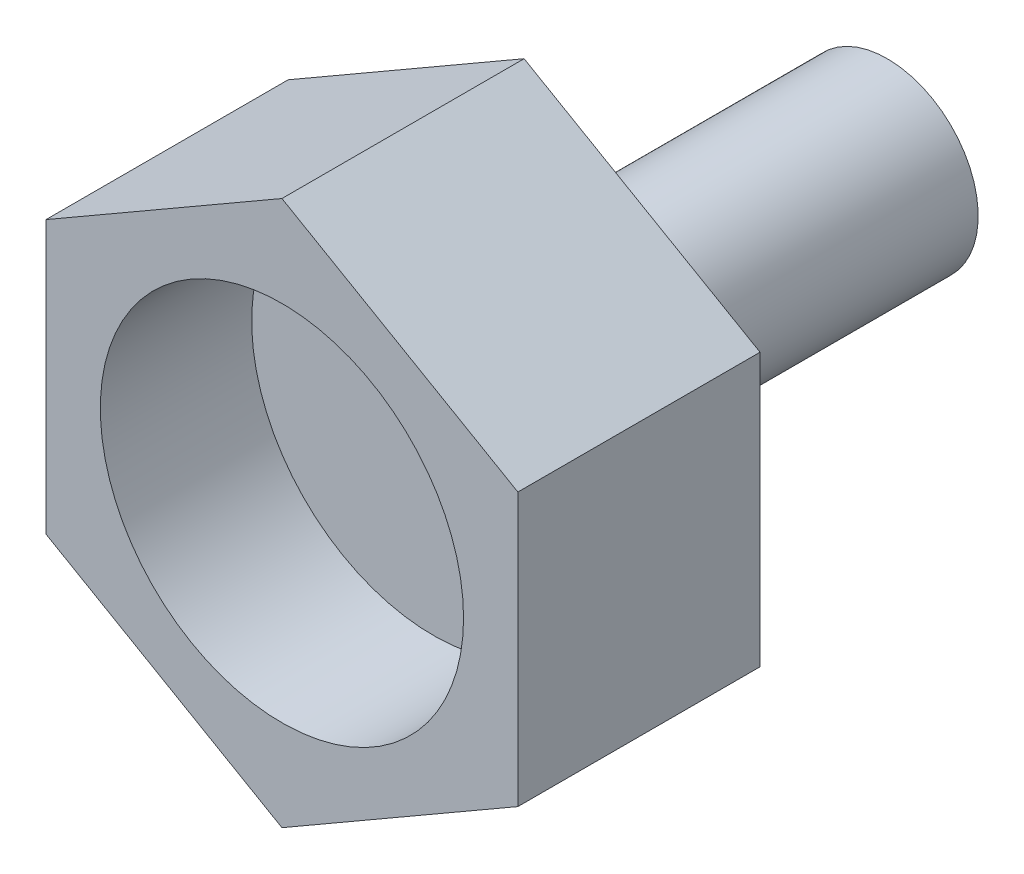
ISO-10303-21;
HEADER;
FILE_DESCRIPTION(('STEP AP214'),'2;1');
FILE_NAME('part.step','',(''),(''),'','','');
FILE_SCHEMA(('AUTOMOTIVE_DESIGN { 1 0 10303 214 1 1 1 1 }'));
ENDSEC;
DATA;
#1=APPLICATION_CONTEXT('core data for automotive mechanical design processes');
#2=APPLICATION_PROTOCOL_DEFINITION('international standard','automotive_design',2000,#1);
#3=PRODUCT_CONTEXT('',#1,'mechanical');
#4=PRODUCT('Part','Part','',(#3));
#5=PRODUCT_RELATED_PRODUCT_CATEGORY('part','',(#4));
#6=PRODUCT_DEFINITION_FORMATION('','',#4);
#7=PRODUCT_DEFINITION_CONTEXT('part definition',#1,'design');
#8=PRODUCT_DEFINITION('design','',#6,#7);
#9=PRODUCT_DEFINITION_SHAPE('','',#8);
#10=(LENGTH_UNIT() NAMED_UNIT(*) SI_UNIT(.MILLI.,.METRE.));
#11=(NAMED_UNIT(*) PLANE_ANGLE_UNIT() SI_UNIT($,.RADIAN.));
#12=(NAMED_UNIT(*) SI_UNIT($,.STERADIAN.) SOLID_ANGLE_UNIT());
#13=UNCERTAINTY_MEASURE_WITH_UNIT(LENGTH_MEASURE(1.E-05),#10,'distance_accuracy_value','');
#14=(GEOMETRIC_REPRESENTATION_CONTEXT(3) GLOBAL_UNCERTAINTY_ASSIGNED_CONTEXT((#13)) GLOBAL_UNIT_ASSIGNED_CONTEXT((#10,
#11,#12)) REPRESENTATION_CONTEXT('',''));
#15=CARTESIAN_POINT('',(0.,0.,0.));
#16=DIRECTION('',(0.,0.,1.));
#17=DIRECTION('',(1.,0.,0.));
#18=AXIS2_PLACEMENT_3D('',#15,#16,#17);
#19=CARTESIAN_POINT('',(0.,-4.5,4.));
#20=DIRECTION('',(-0.5,0.866025403784439,0.));
#21=DIRECTION('',(-0.866025403784439,-0.5,0.));
#22=AXIS2_PLACEMENT_3D('',#19,#20,#21);
#23=PLANE('',#22);
#24=DIRECTION('',(0.866025403784439,0.5,0.));
#25=VECTOR('',#24,1.);
#26=CARTESIAN_POINT('',(0.,-4.5,0.));
#27=LINE('',#26,#25);
#28=CARTESIAN_POINT('',(0.,-4.5,0.));
#29=VERTEX_POINT('',#28);
#30=CARTESIAN_POINT('',(3.89711431702997,-2.25,0.));
#31=VERTEX_POINT('',#30);
#32=EDGE_CURVE('E123',#29,#31,#27,.T.);
#33=ORIENTED_EDGE('',*,*,#32,.T.);
#34=DIRECTION('',(0.,0.,-1.));
#35=VECTOR('',#34,1.);
#36=CARTESIAN_POINT('',(3.89711431702997,-2.25,4.));
#37=LINE('',#36,#35);
#38=CARTESIAN_POINT('',(3.89711431702997,-2.25,4.));
#39=VERTEX_POINT('',#38);
#40=EDGE_CURVE('E40',#39,#31,#37,.T.);
#41=ORIENTED_EDGE('',*,*,#40,.F.);
#42=DIRECTION('',(0.866025403784439,0.5,0.));
#43=VECTOR('',#42,1.);
#44=CARTESIAN_POINT('',(0.,-4.5,4.));
#45=LINE('',#44,#43);
#46=CARTESIAN_POINT('',(0.,-4.5,4.));
#47=VERTEX_POINT('',#46);
#48=EDGE_CURVE('E134',#47,#39,#45,.T.);
#49=ORIENTED_EDGE('',*,*,#48,.F.);
#50=DIRECTION('',(0.,0.,-1.));
#51=VECTOR('',#50,1.);
#52=CARTESIAN_POINT('',(0.,-4.5,4.));
#53=LINE('',#52,#51);
#54=EDGE_CURVE('E119',#47,#29,#53,.T.);
#55=ORIENTED_EDGE('',*,*,#54,.T.);
#56=EDGE_LOOP('',(#33,#41,#49,#55));
#57=FACE_BOUND('',#56,.T.);
#58=ADVANCED_FACE('F37',(#57),#23,.F.);
#59=CARTESIAN_POINT('',(3.89711431702997,-2.25,4.));
#60=DIRECTION('',(-1.,0.,0.));
#61=DIRECTION('',(0.,-1.,0.));
#62=AXIS2_PLACEMENT_3D('',#59,#60,#61);
#63=PLANE('',#62);
#64=DIRECTION('',(0.,1.,0.));
#65=VECTOR('',#64,1.);
#66=CARTESIAN_POINT('',(3.89711431702997,-2.25,0.));
#67=LINE('',#66,#65);
#68=CARTESIAN_POINT('',(3.89711431702997,2.25,0.));
#69=VERTEX_POINT('',#68);
#70=EDGE_CURVE('E126',#31,#69,#67,.T.);
#71=ORIENTED_EDGE('',*,*,#70,.T.);
#72=DIRECTION('',(0.,0.,-1.));
#73=VECTOR('',#72,1.);
#74=CARTESIAN_POINT('',(3.89711431702997,2.25,4.));
#75=LINE('',#74,#73);
#76=CARTESIAN_POINT('',(3.89711431702997,2.25,4.));
#77=VERTEX_POINT('',#76);
#78=EDGE_CURVE('E137',#77,#69,#75,.T.);
#79=ORIENTED_EDGE('',*,*,#78,.F.);
#80=DIRECTION('',(0.,1.,0.));
#81=VECTOR('',#80,1.);
#82=CARTESIAN_POINT('',(3.89711431702997,-2.25,4.));
#83=LINE('',#82,#81);
#84=EDGE_CURVE('E92',#39,#77,#83,.T.);
#85=ORIENTED_EDGE('',*,*,#84,.F.);
#86=ORIENTED_EDGE('',*,*,#40,.T.);
#87=EDGE_LOOP('',(#71,#79,#85,#86));
#88=FACE_BOUND('',#87,.T.);
#89=ADVANCED_FACE('F142',(#88),#63,.F.);
#90=CARTESIAN_POINT('',(3.89711431702997,2.25,4.));
#91=DIRECTION('',(-0.5,-0.866025403784439,0.));
#92=DIRECTION('',(0.866025403784439,-0.5,0.));
#93=AXIS2_PLACEMENT_3D('',#90,#91,#92);
#94=PLANE('',#93);
#95=DIRECTION('',(-0.866025403784439,0.5,0.));
#96=VECTOR('',#95,1.);
#97=CARTESIAN_POINT('',(3.89711431702997,2.25,0.));
#98=LINE('',#97,#96);
#99=CARTESIAN_POINT('',(0.,4.5,0.));
#100=VERTEX_POINT('',#99);
#101=EDGE_CURVE('E129',#69,#100,#98,.T.);
#102=ORIENTED_EDGE('',*,*,#101,.T.);
#103=DIRECTION('',(0.,0.,-1.));
#104=VECTOR('',#103,1.);
#105=CARTESIAN_POINT('',(0.,4.5,4.));
#106=LINE('',#105,#104);
#107=CARTESIAN_POINT('',(0.,4.5,4.));
#108=VERTEX_POINT('',#107);
#109=EDGE_CURVE('E114',#108,#100,#106,.T.);
#110=ORIENTED_EDGE('',*,*,#109,.F.);
#111=DIRECTION('',(-0.866025403784439,0.5,0.));
#112=VECTOR('',#111,1.);
#113=CARTESIAN_POINT('',(3.89711431702997,2.25,4.));
#114=LINE('',#113,#112);
#115=EDGE_CURVE('E105',#77,#108,#114,.T.);
#116=ORIENTED_EDGE('',*,*,#115,.F.);
#117=ORIENTED_EDGE('',*,*,#78,.T.);
#118=EDGE_LOOP('',(#102,#110,#116,#117));
#119=FACE_BOUND('',#118,.T.);
#120=ADVANCED_FACE('F148',(#119),#94,.F.);
#121=CARTESIAN_POINT('',(0.,4.5,4.));
#122=DIRECTION('',(0.5,-0.866025403784439,0.));
#123=DIRECTION('',(0.866025403784439,0.5,0.));
#124=AXIS2_PLACEMENT_3D('',#121,#122,#123);
#125=PLANE('',#124);
#126=DIRECTION('',(-0.866025403784439,-0.5,0.));
#127=VECTOR('',#126,1.);
#128=CARTESIAN_POINT('',(0.,4.5,0.));
#129=LINE('',#128,#127);
#130=CARTESIAN_POINT('',(-3.89711431702997,2.25,0.));
#131=VERTEX_POINT('',#130);
#132=EDGE_CURVE('E113',#100,#131,#129,.T.);
#133=ORIENTED_EDGE('',*,*,#132,.T.);
#134=DIRECTION('',(0.,0.,-1.));
#135=VECTOR('',#134,1.);
#136=CARTESIAN_POINT('',(-3.89711431702997,2.25,4.));
#137=LINE('',#136,#135);
#138=CARTESIAN_POINT('',(-3.89711431702997,2.25,4.));
#139=VERTEX_POINT('',#138);
#140=EDGE_CURVE('E110',#139,#131,#137,.T.);
#141=ORIENTED_EDGE('',*,*,#140,.F.);
#142=DIRECTION('',(-0.866025403784439,-0.5,0.));
#143=VECTOR('',#142,1.);
#144=CARTESIAN_POINT('',(0.,4.5,4.));
#145=LINE('',#144,#143);
#146=EDGE_CURVE('E99',#108,#139,#145,.T.);
#147=ORIENTED_EDGE('',*,*,#146,.F.);
#148=ORIENTED_EDGE('',*,*,#109,.T.);
#149=EDGE_LOOP('',(#133,#141,#147,#148));
#150=FACE_BOUND('',#149,.T.);
#151=ADVANCED_FACE('F111',(#150),#125,.F.);
#152=CARTESIAN_POINT('',(-3.89711431702997,2.25,4.));
#153=DIRECTION('',(1.,0.,0.));
#154=DIRECTION('',(0.,1.,0.));
#155=AXIS2_PLACEMENT_3D('',#152,#153,#154);
#156=PLANE('',#155);
#157=DIRECTION('',(0.,-1.,0.));
#158=VECTOR('',#157,1.);
#159=CARTESIAN_POINT('',(-3.89711431702997,2.25,0.));
#160=LINE('',#159,#158);
#161=CARTESIAN_POINT('',(-3.89711431702997,-2.25,0.));
#162=VERTEX_POINT('',#161);
#163=EDGE_CURVE('E77',#131,#162,#160,.T.);
#164=ORIENTED_EDGE('',*,*,#163,.T.);
#165=DIRECTION('',(0.,0.,-1.));
#166=VECTOR('',#165,1.);
#167=CARTESIAN_POINT('',(-3.89711431702997,-2.25,4.));
#168=LINE('',#167,#166);
#169=CARTESIAN_POINT('',(-3.89711431702997,-2.25,4.));
#170=VERTEX_POINT('',#169);
#171=EDGE_CURVE('E115',#170,#162,#168,.T.);
#172=ORIENTED_EDGE('',*,*,#171,.F.);
#173=DIRECTION('',(0.,-1.,0.));
#174=VECTOR('',#173,1.);
#175=CARTESIAN_POINT('',(-3.89711431702997,2.25,4.));
#176=LINE('',#175,#174);
#177=EDGE_CURVE('E103',#139,#170,#176,.T.);
#178=ORIENTED_EDGE('',*,*,#177,.F.);
#179=ORIENTED_EDGE('',*,*,#140,.T.);
#180=EDGE_LOOP('',(#164,#172,#178,#179));
#181=FACE_BOUND('',#180,.T.);
#182=ADVANCED_FACE('F117',(#181),#156,.F.);
#183=CARTESIAN_POINT('',(-3.89711431702997,-2.25,4.));
#184=DIRECTION('',(0.5,0.866025403784439,0.));
#185=DIRECTION('',(-0.866025403784439,0.5,0.));
#186=AXIS2_PLACEMENT_3D('',#183,#184,#185);
#187=PLANE('',#186);
#188=DIRECTION('',(0.866025403784439,-0.5,0.));
#189=VECTOR('',#188,1.);
#190=CARTESIAN_POINT('',(-3.89711431702997,-2.25,0.));
#191=LINE('',#190,#189);
#192=EDGE_CURVE('E83',#162,#29,#191,.T.);
#193=ORIENTED_EDGE('',*,*,#192,.T.);
#194=ORIENTED_EDGE('',*,*,#54,.F.);
#195=DIRECTION('',(0.866025403784439,-0.5,0.));
#196=VECTOR('',#195,1.);
#197=CARTESIAN_POINT('',(-3.89711431702997,-2.25,4.));
#198=LINE('',#197,#196);
#199=EDGE_CURVE('E54',#170,#47,#198,.T.);
#200=ORIENTED_EDGE('',*,*,#199,.F.);
#201=ORIENTED_EDGE('',*,*,#171,.T.);
#202=EDGE_LOOP('',(#193,#194,#200,#201));
#203=FACE_BOUND('',#202,.T.);
#204=ADVANCED_FACE('F171',(#203),#187,.F.);
#205=CARTESIAN_POINT('',(0.,0.,4.));
#206=DIRECTION('',(0.,0.,1.));
#207=DIRECTION('',(1.,0.,0.));
#208=AXIS2_PLACEMENT_3D('',#205,#206,#207);
#209=PLANE('',#208);
#210=CARTESIAN_POINT('',(0.,0.,4.));
#211=DIRECTION('',(0.,0.,1.));
#212=DIRECTION('',(1.,0.,0.));
#213=AXIS2_PLACEMENT_3D('',#210,#211,#212);
#214=CIRCLE('',#213,3.);
#215=CARTESIAN_POINT('',(3.,0.,4.));
#216=VERTEX_POINT('',#215);
#217=EDGE_CURVE('E155',#216,#216,#214,.T.);
#218=ORIENTED_EDGE('',*,*,#217,.F.);
#219=EDGE_LOOP('',(#218));
#220=FACE_BOUND('',#219,.T.);
#221=ORIENTED_EDGE('',*,*,#48,.T.);
#222=ORIENTED_EDGE('',*,*,#84,.T.);
#223=ORIENTED_EDGE('',*,*,#115,.T.);
#224=ORIENTED_EDGE('',*,*,#146,.T.);
#225=ORIENTED_EDGE('',*,*,#177,.T.);
#226=ORIENTED_EDGE('',*,*,#199,.T.);
#227=EDGE_LOOP('',(#221,#222,#223,#224,#225,#226));
#228=FACE_BOUND('',#227,.T.);
#229=ADVANCED_FACE('F101',(#220,#228),#209,.T.);
#230=CARTESIAN_POINT('',(0.,0.,0.));
#231=DIRECTION('',(0.,0.,1.));
#232=DIRECTION('',(1.,0.,0.));
#233=AXIS2_PLACEMENT_3D('',#230,#231,#232);
#234=PLANE('',#233);
#235=CARTESIAN_POINT('',(0.,0.,0.));
#236=DIRECTION('',(0.,0.,-1.));
#237=DIRECTION('',(-1.,0.,0.));
#238=AXIS2_PLACEMENT_3D('',#235,#236,#237);
#239=CIRCLE('',#238,1.5);
#240=CARTESIAN_POINT('',(-1.5,0.,0.));
#241=VERTEX_POINT('',#240);
#242=EDGE_CURVE('E11',#241,#241,#239,.T.);
#243=ORIENTED_EDGE('',*,*,#242,.F.);
#244=EDGE_LOOP('',(#243));
#245=FACE_BOUND('',#244,.T.);
#246=ORIENTED_EDGE('',*,*,#32,.F.);
#247=ORIENTED_EDGE('',*,*,#192,.F.);
#248=ORIENTED_EDGE('',*,*,#163,.F.);
#249=ORIENTED_EDGE('',*,*,#132,.F.);
#250=ORIENTED_EDGE('',*,*,#101,.F.);
#251=ORIENTED_EDGE('',*,*,#70,.F.);
#252=EDGE_LOOP('',(#246,#247,#248,#249,#250,#251));
#253=FACE_BOUND('',#252,.T.);
#254=ADVANCED_FACE('F147',(#245,#253),#234,.F.);
#255=CARTESIAN_POINT('',(0.,0.,-6.));
#256=DIRECTION('',(0.,0.,1.));
#257=DIRECTION('',(1.,0.,0.));
#258=AXIS2_PLACEMENT_3D('',#255,#256,#257);
#259=CYLINDRICAL_SURFACE('',#258,1.5);
#260=CARTESIAN_POINT('',(0.,0.,-6.));
#261=DIRECTION('',(0.,0.,-1.));
#262=DIRECTION('',(-1.,0.,0.));
#263=AXIS2_PLACEMENT_3D('',#260,#261,#262);
#264=CIRCLE('',#263,1.5);
#265=CARTESIAN_POINT('',(-1.5,0.,-6.));
#266=VERTEX_POINT('',#265);
#267=EDGE_CURVE('E127',#266,#266,#264,.T.);
#268=ORIENTED_EDGE('',*,*,#267,.F.);
#269=EDGE_LOOP('',(#268));
#270=FACE_BOUND('',#269,.T.);
#271=ORIENTED_EDGE('',*,*,#242,.T.);
#272=EDGE_LOOP('',(#271));
#273=FACE_BOUND('',#272,.T.);
#274=ADVANCED_FACE('F177',(#270,#273),#259,.T.);
#275=CARTESIAN_POINT('',(0.,0.,-6.));
#276=DIRECTION('',(0.,0.,-1.));
#277=DIRECTION('',(-1.,0.,0.));
#278=AXIS2_PLACEMENT_3D('',#275,#276,#277);
#279=PLANE('',#278);
#280=ORIENTED_EDGE('',*,*,#267,.T.);
#281=EDGE_LOOP('',(#280));
#282=FACE_BOUND('',#281,.T.);
#283=ADVANCED_FACE('F166',(#282),#279,.T.);
#284=CARTESIAN_POINT('',(0.,0.,1.5));
#285=DIRECTION('',(0.,0.,1.));
#286=DIRECTION('',(1.,0.,0.));
#287=AXIS2_PLACEMENT_3D('',#284,#285,#286);
#288=CYLINDRICAL_SURFACE('',#287,3.);
#289=CARTESIAN_POINT('',(0.,0.,1.5));
#290=DIRECTION('',(0.,0.,1.));
#291=DIRECTION('',(1.,0.,0.));
#292=AXIS2_PLACEMENT_3D('',#289,#290,#291);
#293=CIRCLE('',#292,3.);
#294=CARTESIAN_POINT('',(3.,0.,1.5));
#295=VERTEX_POINT('',#294);
#296=EDGE_CURVE('E154',#295,#295,#293,.T.);
#297=ORIENTED_EDGE('',*,*,#296,.F.);
#298=EDGE_LOOP('',(#297));
#299=FACE_BOUND('',#298,.T.);
#300=ORIENTED_EDGE('',*,*,#217,.T.);
#301=EDGE_LOOP('',(#300));
#302=FACE_BOUND('',#301,.T.);
#303=ADVANCED_FACE('F163',(#299,#302),#288,.F.);
#304=CARTESIAN_POINT('',(0.,0.,1.5));
#305=DIRECTION('',(0.,0.,1.));
#306=DIRECTION('',(1.,0.,0.));
#307=AXIS2_PLACEMENT_3D('',#304,#305,#306);
#308=PLANE('',#307);
#309=ORIENTED_EDGE('',*,*,#296,.T.);
#310=EDGE_LOOP('',(#309));
#311=FACE_BOUND('',#310,.T.);
#312=ADVANCED_FACE('F161',(#311),#308,.T.);
#313=CLOSED_SHELL('',(#58,#89,#120,#151,#182,#204,#229,#254,#274,#283,#303,#312));
#314=MANIFOLD_SOLID_BREP('B2',#313);
#315=ADVANCED_BREP_SHAPE_REPRESENTATION('',(#18,#314),#14);
#316=SHAPE_DEFINITION_REPRESENTATION(#9,#315);
ENDSEC;
END-ISO-10303-21;
